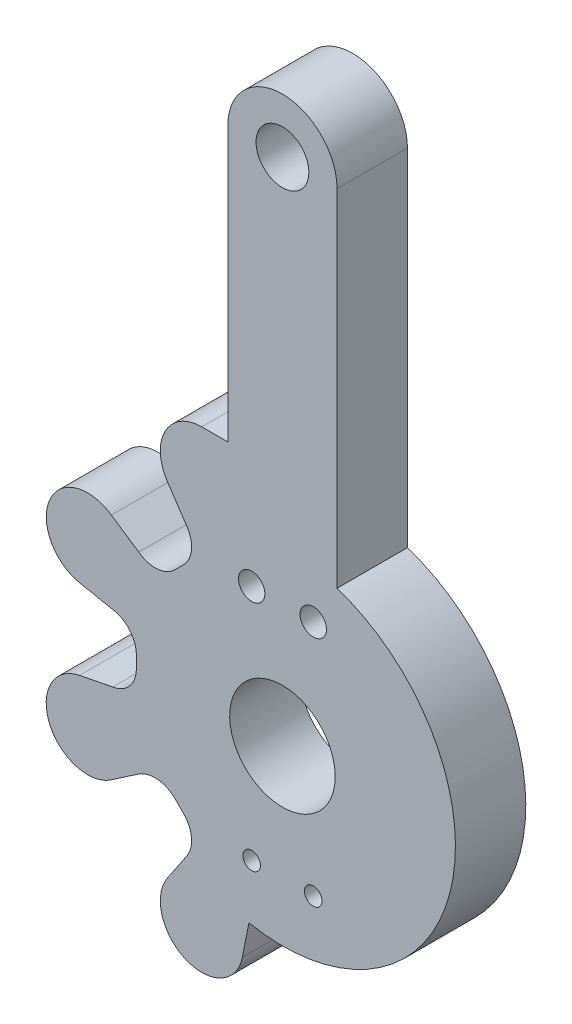
ISO-10303-21;
HEADER;
FILE_DESCRIPTION(('STEP AP214'),'2;1');
FILE_NAME('part.step','',(''),(''),'','','');
FILE_SCHEMA(('AUTOMOTIVE_DESIGN { 1 0 10303 214 1 1 1 1 }'));
ENDSEC;
DATA;
#1=APPLICATION_CONTEXT('core data for automotive mechanical design processes');
#2=APPLICATION_PROTOCOL_DEFINITION('international standard','automotive_design',2000,#1);
#3=PRODUCT_CONTEXT('',#1,'mechanical');
#4=PRODUCT('Part','Part','',(#3));
#5=PRODUCT_RELATED_PRODUCT_CATEGORY('part','',(#4));
#6=PRODUCT_DEFINITION_FORMATION('','',#4);
#7=PRODUCT_DEFINITION_CONTEXT('part definition',#1,'design');
#8=PRODUCT_DEFINITION('design','',#6,#7);
#9=PRODUCT_DEFINITION_SHAPE('','',#8);
#10=(LENGTH_UNIT() NAMED_UNIT(*) SI_UNIT(.MILLI.,.METRE.));
#11=(NAMED_UNIT(*) PLANE_ANGLE_UNIT() SI_UNIT($,.RADIAN.));
#12=(NAMED_UNIT(*) SI_UNIT($,.STERADIAN.) SOLID_ANGLE_UNIT());
#13=UNCERTAINTY_MEASURE_WITH_UNIT(LENGTH_MEASURE(1.E-05),#10,'distance_accuracy_value','');
#14=(GEOMETRIC_REPRESENTATION_CONTEXT(3) GLOBAL_UNCERTAINTY_ASSIGNED_CONTEXT((#13)) GLOBAL_UNIT_ASSIGNED_CONTEXT((#10,
#11,#12)) REPRESENTATION_CONTEXT('',''));
#15=CARTESIAN_POINT('',(0.,0.,0.));
#16=DIRECTION('',(0.,0.,1.));
#17=DIRECTION('',(1.,0.,0.));
#18=AXIS2_PLACEMENT_3D('',#15,#16,#17);
#19=CARTESIAN_POINT('',(6.69256607699613,20.6626330663528,-4.));
#20=DIRECTION('',(0.,0.,1.));
#21=DIRECTION('',(0.,-1.,0.));
#22=AXIS2_PLACEMENT_3D('',#19,#20,#21);
#23=CYLINDRICAL_SURFACE('',#22,1.57399668853809);
#24=CARTESIAN_POINT('',(6.69256607699613,20.6626330663528,0.));
#25=DIRECTION('',(0.,0.,-1.));
#26=DIRECTION('',(0.,1.,0.));
#27=AXIS2_PLACEMENT_3D('',#24,#25,#26);
#28=CIRCLE('',#27,1.57399668853809);
#29=CARTESIAN_POINT('',(7.95775462852621,21.598989571433,0.));
#30=VERTEX_POINT('',#29);
#31=CARTESIAN_POINT('',(7.80545011907268,19.5495496532969,0.));
#32=VERTEX_POINT('',#31);
#33=EDGE_CURVE('E272',#30,#32,#28,.T.);
#34=ORIENTED_EDGE('',*,*,#33,.F.);
#35=DIRECTION('',(0.,0.,1.));
#36=VECTOR('',#35,1.);
#37=CARTESIAN_POINT('',(7.95775462852621,21.598989571433,-4.));
#38=LINE('',#37,#36);
#39=CARTESIAN_POINT('',(7.95775462852621,21.598989571433,-4.));
#40=VERTEX_POINT('',#39);
#41=EDGE_CURVE('E11',#40,#30,#38,.T.);
#42=ORIENTED_EDGE('',*,*,#41,.F.);
#43=CARTESIAN_POINT('',(6.69256607699613,20.6626330663528,-4.));
#44=DIRECTION('',(0.,0.,-1.));
#45=DIRECTION('',(0.,1.,0.));
#46=AXIS2_PLACEMENT_3D('',#43,#44,#45);
#47=CIRCLE('',#46,1.57399668853809);
#48=CARTESIAN_POINT('',(7.80545011907268,19.5495496532969,-4.));
#49=VERTEX_POINT('',#48);
#50=EDGE_CURVE('E386',#40,#49,#47,.T.);
#51=ORIENTED_EDGE('',*,*,#50,.T.);
#52=DIRECTION('',(0.,0.,1.));
#53=VECTOR('',#52,1.);
#54=CARTESIAN_POINT('',(7.80545011907268,19.5495496532969,-4.));
#55=LINE('',#54,#53);
#56=EDGE_CURVE('E62',#49,#32,#55,.T.);
#57=ORIENTED_EDGE('',*,*,#56,.T.);
#58=EDGE_LOOP('',(#34,#42,#51,#57));
#59=FACE_BOUND('',#58,.T.);
#60=ADVANCED_FACE('F45',(#59),#23,.F.);
#61=CARTESIAN_POINT('',(15.4804527957904,10.3819858020936,-4.));
#62=DIRECTION('',(0.830519762885267,0.556989159191631,0.));
#63=DIRECTION('',(-0.55698915919163,0.830519762885267,0.));
#64=AXIS2_PLACEMENT_3D('',#61,#62,#63);
#65=PLANE('',#64);
#66=DIRECTION('',(-0.556989159191631,0.830519762885267,0.));
#67=VECTOR('',#66,1.);
#68=CARTESIAN_POINT('',(15.4804527957904,10.3819858020936,0.));
#69=LINE('',#68,#67);
#70=CARTESIAN_POINT('',(6.86639975184647,23.226295558356,0.));
#71=VERTEX_POINT('',#70);
#72=EDGE_CURVE('E275',#30,#71,#69,.T.);
#73=ORIENTED_EDGE('',*,*,#72,.T.);
#74=DIRECTION('',(0.,0.,1.));
#75=VECTOR('',#74,1.);
#76=CARTESIAN_POINT('',(6.86639975184647,23.226295558356,-4.));
#77=LINE('',#76,#75);
#78=CARTESIAN_POINT('',(6.86639975184647,23.226295558356,-4.));
#79=VERTEX_POINT('',#78);
#80=EDGE_CURVE('E54',#79,#71,#77,.T.);
#81=ORIENTED_EDGE('',*,*,#80,.F.);
#82=DIRECTION('',(-0.556989159191631,0.830519762885267,0.));
#83=VECTOR('',#82,1.);
#84=CARTESIAN_POINT('',(15.4804527957904,10.3819858020936,-4.));
#85=LINE('',#84,#83);
#86=EDGE_CURVE('E484',#40,#79,#85,.T.);
#87=ORIENTED_EDGE('',*,*,#86,.F.);
#88=ORIENTED_EDGE('',*,*,#41,.T.);
#89=EDGE_LOOP('',(#73,#81,#87,#88));
#90=FACE_BOUND('',#89,.T.);
#91=ADVANCED_FACE('F566',(#90),#65,.F.);
#92=CARTESIAN_POINT('',(8.84212914386415,24.5059761362511,-4.));
#93=DIRECTION('',(0.,0.,1.));
#94=DIRECTION('',(0.,-1.,0.));
#95=AXIS2_PLACEMENT_3D('',#92,#93,#94);
#96=CYLINDRICAL_SURFACE('',#95,2.35395178623617);
#97=CARTESIAN_POINT('',(8.84212914386415,24.5059761362511,0.));
#98=DIRECTION('',(0.,0.,-1.));
#99=DIRECTION('',(0.,1.,0.));
#100=AXIS2_PLACEMENT_3D('',#97,#98,#99);
#101=CIRCLE('',#100,2.35395178623617);
#102=CARTESIAN_POINT('',(8.84212914386416,26.8599279224873,0.));
#103=VERTEX_POINT('',#102);
#104=EDGE_CURVE('E278',#71,#103,#101,.T.);
#105=ORIENTED_EDGE('',*,*,#104,.T.);
#106=DIRECTION('',(0.,0.,1.));
#107=VECTOR('',#106,1.);
#108=CARTESIAN_POINT('',(8.84212914386416,26.8599279224873,-4.));
#109=LINE('',#108,#107);
#110=CARTESIAN_POINT('',(8.84212914386416,26.8599279224873,-4.));
#111=VERTEX_POINT('',#110);
#112=EDGE_CURVE('E451',#111,#103,#109,.T.);
#113=ORIENTED_EDGE('',*,*,#112,.F.);
#114=CARTESIAN_POINT('',(8.84212914386415,24.5059761362511,-4.));
#115=DIRECTION('',(0.,0.,-1.));
#116=DIRECTION('',(0.,1.,0.));
#117=AXIS2_PLACEMENT_3D('',#114,#115,#116);
#118=CIRCLE('',#117,2.35395178623617);
#119=EDGE_CURVE('E461',#79,#111,#118,.T.);
#120=ORIENTED_EDGE('',*,*,#119,.F.);
#121=ORIENTED_EDGE('',*,*,#80,.T.);
#122=EDGE_LOOP('',(#105,#113,#120,#121));
#123=FACE_BOUND('',#122,.T.);
#124=ADVANCED_FACE('F459',(#123),#96,.T.);
#125=CARTESIAN_POINT('',(1.25692176145882E-13,26.8599279224873,-4.));
#126=DIRECTION('',(0.,1.,0.));
#127=DIRECTION('',(-1.,0.,0.));
#128=AXIS2_PLACEMENT_3D('',#125,#126,#127);
#129=PLANE('',#128);
#130=DIRECTION('',(-1.,0.,0.));
#131=VECTOR('',#130,1.);
#132=CARTESIAN_POINT('',(1.25690431181717E-13,26.8599279224873,0.));
#133=LINE('',#132,#131);
#134=CARTESIAN_POINT('',(10.324964299798,26.8599279224873,0.));
#135=VERTEX_POINT('',#134);
#136=EDGE_CURVE('E282',#135,#103,#133,.T.);
#137=ORIENTED_EDGE('',*,*,#136,.F.);
#138=DIRECTION('',(0.,0.,1.));
#139=VECTOR('',#138,1.);
#140=CARTESIAN_POINT('',(10.324964299798,26.8599279224873,-4.));
#141=LINE('',#140,#139);
#142=CARTESIAN_POINT('',(10.324964299798,26.8599279224873,-4.));
#143=VERTEX_POINT('',#142);
#144=EDGE_CURVE('E448',#143,#135,#141,.T.);
#145=ORIENTED_EDGE('',*,*,#144,.F.);
#146=DIRECTION('',(-1.,0.,0.));
#147=VECTOR('',#146,1.);
#148=CARTESIAN_POINT('',(1.25692176145882E-13,26.8599279224873,-4.));
#149=LINE('',#148,#147);
#150=EDGE_CURVE('E474',#143,#111,#149,.T.);
#151=ORIENTED_EDGE('',*,*,#150,.T.);
#152=ORIENTED_EDGE('',*,*,#112,.T.);
#153=EDGE_LOOP('',(#137,#145,#151,#152));
#154=FACE_BOUND('',#153,.T.);
#155=ADVANCED_FACE('F471',(#154),#129,.T.);
#156=CARTESIAN_POINT('',(10.324964299798,0.,-4.));
#157=DIRECTION('',(-1.,0.,0.));
#158=DIRECTION('',(0.,-1.,0.));
#159=AXIS2_PLACEMENT_3D('',#156,#157,#158);
#160=PLANE('',#159);
#161=DIRECTION('',(0.,-1.,0.));
#162=VECTOR('',#161,1.);
#163=CARTESIAN_POINT('',(10.324964299798,0.,0.));
#164=LINE('',#163,#162);
#165=CARTESIAN_POINT('',(10.324964299798,42.4299674220899,0.));
#166=VERTEX_POINT('',#165);
#167=EDGE_CURVE('E286',#166,#135,#164,.T.);
#168=ORIENTED_EDGE('',*,*,#167,.F.);
#169=DIRECTION('',(0.,0.,1.));
#170=VECTOR('',#169,1.);
#171=CARTESIAN_POINT('',(10.324964299798,42.4299674220899,-4.));
#172=LINE('',#171,#170);
#173=CARTESIAN_POINT('',(10.324964299798,42.4299674220899,-4.));
#174=VERTEX_POINT('',#173);
#175=EDGE_CURVE('E445',#174,#166,#172,.T.);
#176=ORIENTED_EDGE('',*,*,#175,.F.);
#177=DIRECTION('',(0.,-1.,0.));
#178=VECTOR('',#177,1.);
#179=CARTESIAN_POINT('',(10.324964299798,0.,-4.));
#180=LINE('',#179,#178);
#181=EDGE_CURVE('E478',#174,#143,#180,.T.);
#182=ORIENTED_EDGE('',*,*,#181,.T.);
#183=ORIENTED_EDGE('',*,*,#144,.T.);
#184=EDGE_LOOP('',(#168,#176,#182,#183));
#185=FACE_BOUND('',#184,.T.);
#186=ADVANCED_FACE('F858',(#185),#160,.T.);
#187=CARTESIAN_POINT('',(13.4299644269049,42.4299674220899,-4.));
#188=DIRECTION('',(0.,0.,1.));
#189=DIRECTION('',(0.,-1.,0.));
#190=AXIS2_PLACEMENT_3D('',#187,#188,#189);
#191=CYLINDRICAL_SURFACE('',#190,3.10499982955597);
#192=CARTESIAN_POINT('',(13.4299644269049,42.4299674220899,0.));
#193=DIRECTION('',(0.,0.,-1.));
#194=DIRECTION('',(0.,1.,0.));
#195=AXIS2_PLACEMENT_3D('',#192,#193,#194);
#196=CIRCLE('',#195,3.10499982955597);
#197=CARTESIAN_POINT('',(16.53496395891,42.4299674220899,0.));
#198=VERTEX_POINT('',#197);
#199=EDGE_CURVE('E290',#166,#198,#196,.T.);
#200=ORIENTED_EDGE('',*,*,#199,.T.);
#201=DIRECTION('',(0.,0.,1.));
#202=VECTOR('',#201,1.);
#203=CARTESIAN_POINT('',(16.53496395891,42.4299674220899,-4.));
#204=LINE('',#203,#202);
#205=CARTESIAN_POINT('',(16.53496395891,42.4299674220899,-4.));
#206=VERTEX_POINT('',#205);
#207=EDGE_CURVE('E441',#206,#198,#204,.T.);
#208=ORIENTED_EDGE('',*,*,#207,.F.);
#209=CARTESIAN_POINT('',(13.4299644269049,42.4299674220899,-4.));
#210=DIRECTION('',(0.,0.,-1.));
#211=DIRECTION('',(0.,1.,0.));
#212=AXIS2_PLACEMENT_3D('',#209,#210,#211);
#213=CIRCLE('',#212,3.10499982955597);
#214=EDGE_CURVE('E482',#174,#206,#213,.T.);
#215=ORIENTED_EDGE('',*,*,#214,.F.);
#216=ORIENTED_EDGE('',*,*,#175,.T.);
#217=EDGE_LOOP('',(#200,#208,#215,#216));
#218=FACE_BOUND('',#217,.T.);
#219=ADVANCED_FACE('F847',(#218),#191,.T.);
#220=CARTESIAN_POINT('',(16.53496395891,0.,-4.));
#221=DIRECTION('',(-1.,0.,0.));
#222=DIRECTION('',(0.,0.,1.));
#223=AXIS2_PLACEMENT_3D('',#220,#221,#222);
#224=PLANE('',#223);
#225=DIRECTION('',(0.,-1.,0.));
#226=VECTOR('',#225,1.);
#227=CARTESIAN_POINT('',(16.53496395891,0.,0.));
#228=LINE('',#227,#226);
#229=CARTESIAN_POINT('',(16.53496395891,22.7593281729962,0.));
#230=VERTEX_POINT('',#229);
#231=EDGE_CURVE('E293',#198,#230,#228,.T.);
#232=ORIENTED_EDGE('',*,*,#231,.T.);
#233=DIRECTION('',(0.,0.,1.));
#234=VECTOR('',#233,1.);
#235=CARTESIAN_POINT('',(16.53496395891,22.7593281729962,-4.));
#236=LINE('',#235,#234);
#237=CARTESIAN_POINT('',(16.53496395891,22.7593281729962,-4.));
#238=VERTEX_POINT('',#237);
#239=EDGE_CURVE('E437',#238,#230,#236,.T.);
#240=ORIENTED_EDGE('',*,*,#239,.F.);
#241=DIRECTION('',(0.,-1.,0.));
#242=VECTOR('',#241,1.);
#243=CARTESIAN_POINT('',(16.53496395891,0.,-4.));
#244=LINE('',#243,#242);
#245=EDGE_CURVE('E490',#206,#238,#244,.T.);
#246=ORIENTED_EDGE('',*,*,#245,.F.);
#247=ORIENTED_EDGE('',*,*,#207,.T.);
#248=EDGE_LOOP('',(#232,#240,#246,#247));
#249=FACE_BOUND('',#248,.T.);
#250=ADVANCED_FACE('F836',(#249),#224,.F.);
#251=CARTESIAN_POINT('',(13.4299643635908,13.4299640810346,-4.));
#252=DIRECTION('',(0.,0.,1.));
#253=DIRECTION('',(0.,-1.,0.));
#254=AXIS2_PLACEMENT_3D('',#251,#252,#253);
#255=CYLINDRICAL_SURFACE('',#254,9.83250003037452);
#256=CARTESIAN_POINT('',(13.4299643635908,13.4299640810346,0.));
#257=DIRECTION('',(0.,0.,-1.));
#258=DIRECTION('',(0.,1.,0.));
#259=AXIS2_PLACEMENT_3D('',#256,#257,#258);
#260=CIRCLE('',#259,9.83250003037452);
#261=CARTESIAN_POINT('',(11.5238211932177,3.78399730411921,0.));
#262=VERTEX_POINT('',#261);
#263=EDGE_CURVE('E296',#230,#262,#260,.T.);
#264=ORIENTED_EDGE('',*,*,#263,.T.);
#265=DIRECTION('',(0.,0.,1.));
#266=VECTOR('',#265,1.);
#267=CARTESIAN_POINT('',(11.5238211932177,3.78399730411921,-4.));
#268=LINE('',#267,#266);
#269=CARTESIAN_POINT('',(11.5238211932177,3.78399730411921,-4.));
#270=VERTEX_POINT('',#269);
#271=EDGE_CURVE('E434',#270,#262,#268,.T.);
#272=ORIENTED_EDGE('',*,*,#271,.F.);
#273=CARTESIAN_POINT('',(13.4299643635908,13.4299640810346,-4.));
#274=DIRECTION('',(0.,0.,-1.));
#275=DIRECTION('',(0.,1.,0.));
#276=AXIS2_PLACEMENT_3D('',#273,#274,#275);
#277=CIRCLE('',#276,9.83250003037452);
#278=EDGE_CURVE('E493',#238,#270,#277,.T.);
#279=ORIENTED_EDGE('',*,*,#278,.F.);
#280=ORIENTED_EDGE('',*,*,#239,.T.);
#281=EDGE_LOOP('',(#264,#272,#279,#280));
#282=FACE_BOUND('',#281,.T.);
#283=ADVANCED_FACE('F825',(#282),#255,.T.);
#284=CARTESIAN_POINT('',(10.3725731493547,-2.0476794372538,-4.));
#285=DIRECTION('',(0.981065743318815,-0.193675004288887,0.));
#286=DIRECTION('',(0.193675004288887,0.981065743318815,0.));
#287=AXIS2_PLACEMENT_3D('',#284,#285,#286);
#288=PLANE('',#287);
#289=DIRECTION('',(0.193675004288887,0.981065743318815,0.));
#290=VECTOR('',#289,1.);
#291=CARTESIAN_POINT('',(10.3725731493547,-2.0476794372538,0.));
#292=LINE('',#291,#290);
#293=CARTESIAN_POINT('',(11.1515109927373,1.89805035437945,0.));
#294=VERTEX_POINT('',#293);
#295=EDGE_CURVE('E300',#294,#262,#292,.T.);
#296=ORIENTED_EDGE('',*,*,#295,.F.);
#297=DIRECTION('',(0.,0.,1.));
#298=VECTOR('',#297,1.);
#299=CARTESIAN_POINT('',(11.1515109927373,1.89805035437945,-4.));
#300=LINE('',#299,#298);
#301=CARTESIAN_POINT('',(11.1515109927373,1.89805035437945,-4.));
#302=VERTEX_POINT('',#301);
#303=EDGE_CURVE('E431',#302,#294,#300,.T.);
#304=ORIENTED_EDGE('',*,*,#303,.F.);
#305=DIRECTION('',(0.193675004288887,0.981065743318815,0.));
#306=VECTOR('',#305,1.);
#307=CARTESIAN_POINT('',(10.3725731493547,-2.0476794372538,-4.));
#308=LINE('',#307,#306);
#309=EDGE_CURVE('E496',#302,#270,#308,.T.);
#310=ORIENTED_EDGE('',*,*,#309,.T.);
#311=ORIENTED_EDGE('',*,*,#271,.T.);
#312=EDGE_LOOP('',(#296,#304,#310,#311));
#313=FACE_BOUND('',#312,.T.);
#314=ADVANCED_FACE('F814',(#313),#288,.T.);
#315=CARTESIAN_POINT('',(8.84212942262603,2.35395199862902,-4.));
#316=DIRECTION('',(0.,0.,1.));
#317=DIRECTION('',(0.,-1.,0.));
#318=AXIS2_PLACEMENT_3D('',#315,#316,#317);
#319=CYLINDRICAL_SURFACE('',#318,2.35395189959334);
#320=CARTESIAN_POINT('',(8.84212942262603,2.35395199862902,0.));
#321=DIRECTION('',(0.,0.,-1.));
#322=DIRECTION('',(0.,1.,0.));
#323=AXIS2_PLACEMENT_3D('',#320,#321,#322);
#324=CIRCLE('',#323,2.35395189959334);
#325=CARTESIAN_POINT('',(6.86639975184648,3.63363235465564,0.));
#326=VERTEX_POINT('',#325);
#327=EDGE_CURVE('E304',#294,#326,#324,.T.);
#328=ORIENTED_EDGE('',*,*,#327,.T.);
#329=DIRECTION('',(0.,0.,1.));
#330=VECTOR('',#329,1.);
#331=CARTESIAN_POINT('',(6.86639975184648,3.63363235465564,-4.));
#332=LINE('',#331,#330);
#333=CARTESIAN_POINT('',(6.86639975184648,3.63363235465564,-4.));
#334=VERTEX_POINT('',#333);
#335=EDGE_CURVE('E427',#334,#326,#332,.T.);
#336=ORIENTED_EDGE('',*,*,#335,.F.);
#337=CARTESIAN_POINT('',(8.84212942262603,2.35395199862902,-4.));
#338=DIRECTION('',(0.,0.,-1.));
#339=DIRECTION('',(0.,1.,0.));
#340=AXIS2_PLACEMENT_3D('',#337,#338,#339);
#341=CIRCLE('',#340,2.35395189959334);
#342=EDGE_CURVE('E500',#302,#334,#341,.T.);
#343=ORIENTED_EDGE('',*,*,#342,.F.);
#344=ORIENTED_EDGE('',*,*,#303,.T.);
#345=EDGE_LOOP('',(#328,#336,#343,#344));
#346=FACE_BOUND('',#345,.T.);
#347=ADVANCED_FACE('F803',(#346),#319,.T.);
#348=CARTESIAN_POINT('',(3.05876763685765,-2.04938129675285,-4.));
#349=DIRECTION('',(0.830769101313786,-0.556617193681874,0.));
#350=DIRECTION('',(0.556617193681874,0.830769101313786,0.));
#351=AXIS2_PLACEMENT_3D('',#348,#349,#350);
#352=PLANE('',#351);
#353=DIRECTION('',(0.556617193681874,0.830769101313786,0.));
#354=VECTOR('',#353,1.);
#355=CARTESIAN_POINT('',(3.05876763685765,-2.04938129675285,0.));
#356=LINE('',#355,#354);
#357=CARTESIAN_POINT('',(7.95702578980674,5.26142686713257,0.));
#358=VERTEX_POINT('',#357);
#359=EDGE_CURVE('E307',#326,#358,#356,.T.);
#360=ORIENTED_EDGE('',*,*,#359,.T.);
#361=DIRECTION('',(0.,0.,1.));
#362=VECTOR('',#361,1.);
#363=CARTESIAN_POINT('',(7.95702578980674,5.26142686713257,-4.));
#364=LINE('',#363,#362);
#365=CARTESIAN_POINT('',(7.95702578980674,5.26142686713257,-4.));
#366=VERTEX_POINT('',#365);
#367=EDGE_CURVE('E424',#366,#358,#364,.T.);
#368=ORIENTED_EDGE('',*,*,#367,.F.);
#369=DIRECTION('',(0.556617193681874,0.830769101313786,0.));
#370=VECTOR('',#369,1.);
#371=CARTESIAN_POINT('',(3.05876763685765,-2.04938129675285,-4.));
#372=LINE('',#371,#370);
#373=EDGE_CURVE('E503',#334,#366,#372,.T.);
#374=ORIENTED_EDGE('',*,*,#373,.F.);
#375=ORIENTED_EDGE('',*,*,#335,.T.);
#376=EDGE_LOOP('',(#360,#368,#374,#375));
#377=FACE_BOUND('',#376,.T.);
#378=ADVANCED_FACE('F792',(#377),#352,.F.);
#379=CARTESIAN_POINT('',(6.69060782848511,6.19777630821553,-4.));
#380=DIRECTION('',(0.,0.,1.));
#381=DIRECTION('',(0.,-1.,0.));
#382=AXIS2_PLACEMENT_3D('',#379,#380,#381);
#383=CYLINDRICAL_SURFACE('',#382,1.57498086609787);
#384=CARTESIAN_POINT('',(6.69060782848511,6.19777630821553,0.));
#385=DIRECTION('',(0.,0.,-1.));
#386=DIRECTION('',(0.,1.,0.));
#387=AXIS2_PLACEMENT_3D('',#384,#385,#386);
#388=CIRCLE('',#387,1.57498086609787);
#389=CARTESIAN_POINT('',(7.80288812555303,7.31285355635976,0.));
#390=VERTEX_POINT('',#389);
#391=EDGE_CURVE('E311',#390,#358,#388,.T.);
#392=ORIENTED_EDGE('',*,*,#391,.F.);
#393=DIRECTION('',(0.,0.,1.));
#394=VECTOR('',#393,1.);
#395=CARTESIAN_POINT('',(7.80288812555303,7.31285355635976,-4.));
#396=LINE('',#395,#394);
#397=CARTESIAN_POINT('',(7.80288812555303,7.31285355635976,-4.));
#398=VERTEX_POINT('',#397);
#399=EDGE_CURVE('E421',#398,#390,#396,.T.);
#400=ORIENTED_EDGE('',*,*,#399,.F.);
#401=CARTESIAN_POINT('',(6.69060782848511,6.19777630821553,-4.));
#402=DIRECTION('',(0.,0.,-1.));
#403=DIRECTION('',(0.,1.,0.));
#404=AXIS2_PLACEMENT_3D('',#401,#402,#403);
#405=CIRCLE('',#404,1.57498086609787);
#406=EDGE_CURVE('E506',#398,#366,#405,.T.);
#407=ORIENTED_EDGE('',*,*,#406,.T.);
#408=ORIENTED_EDGE('',*,*,#367,.T.);
#409=EDGE_LOOP('',(#392,#400,#407,#408));
#410=FACE_BOUND('',#409,.T.);
#411=ADVANCED_FACE('F781',(#410),#383,.F.);
#412=CARTESIAN_POINT('',(7.54806103463607,7.56704146384131,-4.));
#413=DIRECTION('',(-0.706218291923553,-0.707994155450862,0.));
#414=DIRECTION('',(0.707994155450862,-0.706218291923553,0.));
#415=AXIS2_PLACEMENT_3D('',#412,#413,#414);
#416=PLANE('',#415);
#417=DIRECTION('',(0.707994155450862,-0.706218291923553,0.));
#418=VECTOR('',#417,1.);
#419=CARTESIAN_POINT('',(7.54806103463607,7.56704146384131,0.));
#420=LINE('',#419,#418);
#421=CARTESIAN_POINT('',(7.33640105933805,7.778170531889,0.));
#422=VERTEX_POINT('',#421);
#423=EDGE_CURVE('E315',#422,#390,#420,.T.);
#424=ORIENTED_EDGE('',*,*,#423,.F.);
#425=DIRECTION('',(0.,0.,1.));
#426=VECTOR('',#425,1.);
#427=CARTESIAN_POINT('',(7.33640105933805,7.778170531889,-4.));
#428=LINE('',#427,#426);
#429=CARTESIAN_POINT('',(7.33640105933805,7.778170531889,-4.));
#430=VERTEX_POINT('',#429);
#431=EDGE_CURVE('E418',#430,#422,#428,.T.);
#432=ORIENTED_EDGE('',*,*,#431,.F.);
#433=DIRECTION('',(0.707994155450862,-0.706218291923553,0.));
#434=VECTOR('',#433,1.);
#435=CARTESIAN_POINT('',(7.54806103463607,7.56704146384131,-4.));
#436=LINE('',#435,#434);
#437=EDGE_CURVE('E510',#430,#398,#436,.T.);
#438=ORIENTED_EDGE('',*,*,#437,.T.);
#439=ORIENTED_EDGE('',*,*,#399,.T.);
#440=EDGE_LOOP('',(#424,#432,#438,#439));
#441=FACE_BOUND('',#440,.T.);
#442=ADVANCED_FACE('F770',(#441),#416,.T.);
#443=CARTESIAN_POINT('',(6.17760406045255,6.61645961056704,-4.));
#444=DIRECTION('',(0.,0.,1.));
#445=DIRECTION('',(0.,-1.,0.));
#446=AXIS2_PLACEMENT_3D('',#443,#444,#445);
#447=CYLINDRICAL_SURFACE('',#446,1.64084817985844);
#448=CARTESIAN_POINT('',(6.17760406045255,6.61645961056704,0.));
#449=DIRECTION('',(0.,0.,-1.));
#450=DIRECTION('',(0.,1.,0.));
#451=AXIS2_PLACEMENT_3D('',#448,#449,#450);
#452=CIRCLE('',#451,1.64084817985844);
#453=CARTESIAN_POINT('',(5.2519104301641,7.97125629353765,0.));
#454=VERTEX_POINT('',#453);
#455=EDGE_CURVE('E319',#454,#422,#452,.T.);
#456=ORIENTED_EDGE('',*,*,#455,.F.);
#457=DIRECTION('',(0.,0.,1.));
#458=VECTOR('',#457,1.);
#459=CARTESIAN_POINT('',(5.2519104301641,7.97125629353765,-4.));
#460=LINE('',#459,#458);
#461=CARTESIAN_POINT('',(5.2519104301641,7.97125629353765,-4.));
#462=VERTEX_POINT('',#461);
#463=EDGE_CURVE('E415',#462,#454,#460,.T.);
#464=ORIENTED_EDGE('',*,*,#463,.F.);
#465=CARTESIAN_POINT('',(6.17760406045255,6.61645961056704,-4.));
#466=DIRECTION('',(0.,0.,-1.));
#467=DIRECTION('',(0.,1.,0.));
#468=AXIS2_PLACEMENT_3D('',#465,#466,#467);
#469=CIRCLE('',#468,1.64084817985844);
#470=EDGE_CURVE('E514',#462,#430,#469,.T.);
#471=ORIENTED_EDGE('',*,*,#470,.T.);
#472=ORIENTED_EDGE('',*,*,#431,.T.);
#473=EDGE_LOOP('',(#456,#464,#471,#472));
#474=FACE_BOUND('',#473,.T.);
#475=ADVANCED_FACE('F759',(#474),#447,.F.);
#476=CARTESIAN_POINT('',(-2.04152151344835,2.98786389377135,-4.));
#477=DIRECTION('',(0.564155563964672,-0.825668516807867,0.));
#478=DIRECTION('',(0.825668516807867,0.564155563964672,0.));
#479=AXIS2_PLACEMENT_3D('',#476,#477,#478);
#480=PLANE('',#479);
#481=DIRECTION('',(0.825668516807867,0.564155563964672,0.));
#482=VECTOR('',#481,1.);
#483=CARTESIAN_POINT('',(-2.04152151344835,2.98786389377135,0.));
#484=LINE('',#483,#482);
#485=CARTESIAN_POINT('',(3.68194692450449,6.89854535820541,0.));
#486=VERTEX_POINT('',#485);
#487=EDGE_CURVE('E323',#486,#454,#484,.T.);
#488=ORIENTED_EDGE('',*,*,#487,.F.);
#489=DIRECTION('',(0.,0.,1.));
#490=VECTOR('',#489,1.);
#491=CARTESIAN_POINT('',(3.68194692450449,6.89854535820541,-4.));
#492=LINE('',#491,#490);
#493=CARTESIAN_POINT('',(3.68194692450449,6.89854535820541,-4.));
#494=VERTEX_POINT('',#493);
#495=EDGE_CURVE('E412',#494,#486,#492,.T.);
#496=ORIENTED_EDGE('',*,*,#495,.F.);
#497=DIRECTION('',(0.825668516807867,0.564155563964672,0.));
#498=VECTOR('',#497,1.);
#499=CARTESIAN_POINT('',(-2.04152151344835,2.98786389377135,-4.));
#500=LINE('',#499,#498);
#501=EDGE_CURVE('E518',#494,#462,#500,.T.);
#502=ORIENTED_EDGE('',*,*,#501,.T.);
#503=ORIENTED_EDGE('',*,*,#463,.T.);
#504=EDGE_LOOP('',(#488,#496,#502,#503));
#505=FACE_BOUND('',#504,.T.);
#506=ADVANCED_FACE('F748',(#505),#480,.T.);
#507=CARTESIAN_POINT('',(2.35395185254456,8.84212934714569,-4.));
#508=DIRECTION('',(0.,0.,1.));
#509=DIRECTION('',(0.,-1.,0.));
#510=AXIS2_PLACEMENT_3D('',#507,#508,#509);
#511=CYLINDRICAL_SURFACE('',#510,2.3539519182037);
#512=CARTESIAN_POINT('',(2.35395185254456,8.84212934714569,0.));
#513=DIRECTION('',(0.,0.,-1.));
#514=DIRECTION('',(0.,1.,0.));
#515=AXIS2_PLACEMENT_3D('',#512,#513,#514);
#516=CIRCLE('',#515,2.3539519182037);
#517=CARTESIAN_POINT('',(1.89874110829165,11.1516472214068,0.));
#518=VERTEX_POINT('',#517);
#519=EDGE_CURVE('E327',#486,#518,#516,.T.);
#520=ORIENTED_EDGE('',*,*,#519,.T.);
#521=DIRECTION('',(0.,0.,1.));
#522=VECTOR('',#521,1.);
#523=CARTESIAN_POINT('',(1.89874110829165,11.1516472214068,-4.));
#524=LINE('',#523,#522);
#525=CARTESIAN_POINT('',(1.89874110829165,11.1516472214068,-4.));
#526=VERTEX_POINT('',#525);
#527=EDGE_CURVE('E408',#526,#518,#524,.T.);
#528=ORIENTED_EDGE('',*,*,#527,.F.);
#529=CARTESIAN_POINT('',(2.35395185254456,8.84212934714569,-4.));
#530=DIRECTION('',(0.,0.,-1.));
#531=DIRECTION('',(0.,1.,0.));
#532=AXIS2_PLACEMENT_3D('',#529,#530,#531);
#533=CIRCLE('',#532,2.3539519182037);
#534=EDGE_CURVE('E522',#494,#526,#533,.T.);
#535=ORIENTED_EDGE('',*,*,#534,.F.);
#536=ORIENTED_EDGE('',*,*,#495,.T.);
#537=EDGE_LOOP('',(#520,#528,#535,#536));
#538=FACE_BOUND('',#537,.T.);
#539=ADVANCED_FACE('F737',(#538),#511,.T.);
#540=CARTESIAN_POINT('',(-2.04480884841034,10.3743653779557,-4.));
#541=DIRECTION('',(0.193381496339268,-0.981123639952471,0.));
#542=DIRECTION('',(0.981123639952471,0.193381496339268,0.));
#543=AXIS2_PLACEMENT_3D('',#540,#541,#542);
#544=PLANE('',#543);
#545=DIRECTION('',(0.981123639952471,0.193381496339268,0.));
#546=VECTOR('',#545,1.);
#547=CARTESIAN_POINT('',(-2.04480884841034,10.3743653779557,0.));
#548=LINE('',#547,#546);
#549=CARTESIAN_POINT('',(3.78410901263927,11.5232571303378,0.));
#550=VERTEX_POINT('',#549);
#551=EDGE_CURVE('E330',#518,#550,#548,.T.);
#552=ORIENTED_EDGE('',*,*,#551,.T.);
#553=DIRECTION('',(0.,0.,1.));
#554=VECTOR('',#553,1.);
#555=CARTESIAN_POINT('',(3.78410901263927,11.5232571303378,-4.));
#556=LINE('',#555,#554);
#557=CARTESIAN_POINT('',(3.78410901263927,11.5232571303378,-4.));
#558=VERTEX_POINT('',#557);
#559=EDGE_CURVE('E405',#558,#550,#556,.T.);
#560=ORIENTED_EDGE('',*,*,#559,.F.);
#561=DIRECTION('',(0.981123639952471,0.193381496339268,0.));
#562=VECTOR('',#561,1.);
#563=CARTESIAN_POINT('',(-2.04480884841034,10.3743653779557,-4.));
#564=LINE('',#563,#562);
#565=EDGE_CURVE('E525',#526,#558,#564,.T.);
#566=ORIENTED_EDGE('',*,*,#565,.F.);
#567=ORIENTED_EDGE('',*,*,#527,.T.);
#568=EDGE_LOOP('',(#552,#560,#566,#567));
#569=FACE_BOUND('',#568,.T.);
#570=ADVANCED_FACE('F726',(#569),#544,.F.);
#571=CARTESIAN_POINT('',(3.55097190573457,13.0808051425338,-4.));
#572=DIRECTION('',(0.,0.,1.));
#573=DIRECTION('',(0.,-1.,0.));
#574=AXIS2_PLACEMENT_3D('',#571,#572,#573);
#575=CYLINDRICAL_SURFACE('',#574,1.5748995907396);
#576=CARTESIAN_POINT('',(3.55097190573457,13.0808051425338,0.));
#577=DIRECTION('',(0.,0.,-1.));
#578=DIRECTION('',(0.,1.,0.));
#579=AXIS2_PLACEMENT_3D('',#576,#577,#578);
#580=CIRCLE('',#579,1.5748995907396);
#581=CARTESIAN_POINT('',(5.12587149350252,13.0807083948984,0.));
#582=VERTEX_POINT('',#581);
#583=EDGE_CURVE('E334',#582,#550,#580,.T.);
#584=ORIENTED_EDGE('',*,*,#583,.F.);
#585=DIRECTION('',(0.,0.,1.));
#586=VECTOR('',#585,1.);
#587=CARTESIAN_POINT('',(5.12587149350252,13.0807083948984,-4.));
#588=LINE('',#587,#586);
#589=CARTESIAN_POINT('',(5.12587149350252,13.0807083948984,-4.));
#590=VERTEX_POINT('',#589);
#591=EDGE_CURVE('E402',#590,#582,#588,.T.);
#592=ORIENTED_EDGE('',*,*,#591,.F.);
#593=CARTESIAN_POINT('',(3.55097190573457,13.0808051425338,-4.));
#594=DIRECTION('',(0.,0.,-1.));
#595=DIRECTION('',(0.,1.,0.));
#596=AXIS2_PLACEMENT_3D('',#593,#594,#595);
#597=CIRCLE('',#596,1.5748995907396);
#598=EDGE_CURVE('E528',#590,#558,#597,.T.);
#599=ORIENTED_EDGE('',*,*,#598,.T.);
#600=ORIENTED_EDGE('',*,*,#559,.T.);
#601=EDGE_LOOP('',(#584,#592,#599,#600));
#602=FACE_BOUND('',#601,.T.);
#603=ADVANCED_FACE('F715',(#602),#575,.F.);
#604=CARTESIAN_POINT('',(5.12506791333996,-0.000314837978161413,-4.));
#605=DIRECTION('',(0.999999998113117,-6.14309864553934E-05,0.));
#606=DIRECTION('',(6.14309864553934E-05,0.999999998113117,0.));
#607=AXIS2_PLACEMENT_3D('',#604,#605,#606);
#608=PLANE('',#607);
#609=DIRECTION('',(6.14309864553934E-05,0.999999998113117,0.));
#610=VECTOR('',#609,1.);
#611=CARTESIAN_POINT('',(5.12506791333996,-0.000314837978161421,0.));
#612=LINE('',#611,#610);
#613=CARTESIAN_POINT('',(5.12591437754093,13.7787932020696,0.));
#614=VERTEX_POINT('',#613);
#615=EDGE_CURVE('E338',#582,#614,#612,.T.);
#616=ORIENTED_EDGE('',*,*,#615,.T.);
#617=DIRECTION('',(0.,0.,1.));
#618=VECTOR('',#617,1.);
#619=CARTESIAN_POINT('',(5.12591437754093,13.7787932020696,-4.));
#620=LINE('',#619,#618);
#621=CARTESIAN_POINT('',(5.12591437754093,13.7787932020696,-4.));
#622=VERTEX_POINT('',#621);
#623=EDGE_CURVE('E399',#622,#614,#620,.T.);
#624=ORIENTED_EDGE('',*,*,#623,.F.);
#625=DIRECTION('',(6.14309864553934E-05,0.999999998113117,0.));
#626=VECTOR('',#625,1.);
#627=CARTESIAN_POINT('',(5.12506791333996,-0.000314837978161413,-4.));
#628=LINE('',#627,#626);
#629=EDGE_CURVE('E532',#590,#622,#628,.T.);
#630=ORIENTED_EDGE('',*,*,#629,.F.);
#631=ORIENTED_EDGE('',*,*,#591,.T.);
#632=EDGE_LOOP('',(#616,#624,#630,#631));
#633=FACE_BOUND('',#632,.T.);
#634=ADVANCED_FACE('F705',(#633),#608,.F.);
#635=CARTESIAN_POINT('',(3.55133353124685,13.7787932020696,-4.));
#636=DIRECTION('',(0.,0.,1.));
#637=DIRECTION('',(0.,-1.,0.));
#638=AXIS2_PLACEMENT_3D('',#635,#636,#637);
#639=CYLINDRICAL_SURFACE('',#638,1.57458084629409);
#640=CARTESIAN_POINT('',(3.55133353124685,13.7787932020696,0.));
#641=DIRECTION('',(0.,0.,-1.));
#642=DIRECTION('',(0.,1.,0.));
#643=AXIS2_PLACEMENT_3D('',#640,#641,#642);
#644=CIRCLE('',#643,1.57458084629409);
#645=CARTESIAN_POINT('',(3.78399421142372,15.3360901709923,0.));
#646=VERTEX_POINT('',#645);
#647=EDGE_CURVE('E342',#646,#614,#644,.T.);
#648=ORIENTED_EDGE('',*,*,#647,.F.);
#649=DIRECTION('',(0.,0.,1.));
#650=VECTOR('',#649,1.);
#651=CARTESIAN_POINT('',(3.78399421142372,15.3360901709923,-4.));
#652=LINE('',#651,#650);
#653=CARTESIAN_POINT('',(3.78399421142372,15.3360901709923,-4.));
#654=VERTEX_POINT('',#653);
#655=EDGE_CURVE('E396',#654,#646,#652,.T.);
#656=ORIENTED_EDGE('',*,*,#655,.F.);
#657=CARTESIAN_POINT('',(3.55133353124685,13.7787932020696,-4.));
#658=DIRECTION('',(0.,0.,-1.));
#659=DIRECTION('',(0.,1.,0.));
#660=AXIS2_PLACEMENT_3D('',#657,#658,#659);
#661=CIRCLE('',#660,1.57458084629409);
#662=EDGE_CURVE('E535',#654,#622,#661,.T.);
#663=ORIENTED_EDGE('',*,*,#662,.T.);
#664=ORIENTED_EDGE('',*,*,#623,.T.);
#665=EDGE_LOOP('',(#648,#656,#663,#664));
#666=FACE_BOUND('',#665,.T.);
#667=ADVANCED_FACE('F552',(#666),#639,.F.);
#668=CARTESIAN_POINT('',(3.05599050269329,15.4798110736071,-4.));
#669=DIRECTION('',(-0.193679674904566,-0.981064821267617,0.));
#670=DIRECTION('',(0.981064821267617,-0.193679674904566,0.));
#671=AXIS2_PLACEMENT_3D('',#668,#669,#670);
#672=PLANE('',#671);
#673=DIRECTION('',(0.981064821267617,-0.193679674904566,0.));
#674=VECTOR('',#673,1.);
#675=CARTESIAN_POINT('',(3.05599050269329,15.4798110736071,0.));
#676=LINE('',#675,#674);
#677=CARTESIAN_POINT('',(1.90356185999294,15.7073210199739,0.));
#678=VERTEX_POINT('',#677);
#679=EDGE_CURVE('E346',#678,#646,#676,.T.);
#680=ORIENTED_EDGE('',*,*,#679,.F.);
#681=DIRECTION('',(0.,0.,1.));
#682=VECTOR('',#681,1.);
#683=CARTESIAN_POINT('',(1.90356185999294,15.7073210199739,-4.));
#684=LINE('',#683,#682);
#685=CARTESIAN_POINT('',(1.90356185999294,15.7073210199739,-4.));
#686=VERTEX_POINT('',#685);
#687=EDGE_CURVE('E393',#686,#678,#684,.T.);
#688=ORIENTED_EDGE('',*,*,#687,.F.);
#689=DIRECTION('',(0.981064821267617,-0.193679674904566,0.));
#690=VECTOR('',#689,1.);
#691=CARTESIAN_POINT('',(3.05599050269329,15.4798110736071,-4.));
#692=LINE('',#691,#690);
#693=EDGE_CURVE('E539',#686,#654,#692,.T.);
#694=ORIENTED_EDGE('',*,*,#693,.T.);
#695=ORIENTED_EDGE('',*,*,#655,.T.);
#696=EDGE_LOOP('',(#680,#688,#694,#695));
#697=FACE_BOUND('',#696,.T.);
#698=ADVANCED_FACE('F545',(#697),#672,.T.);
#699=CARTESIAN_POINT('',(2.35925735020569,18.0156004761343,-4.));
#700=DIRECTION('',(0.,0.,1.));
#701=DIRECTION('',(0.,-1.,0.));
#702=AXIS2_PLACEMENT_3D('',#699,#700,#701);
#703=CYLINDRICAL_SURFACE('',#702,2.35283072649358);
#704=CARTESIAN_POINT('',(2.35925735020569,18.0156004761343,0.));
#705=DIRECTION('',(0.,0.,-1.));
#706=DIRECTION('',(0.,1.,0.));
#707=AXIS2_PLACEMENT_3D('',#704,#705,#706);
#708=CIRCLE('',#707,2.35283072649358);
#709=CARTESIAN_POINT('',(3.70363712623404,19.9465213562685,0.));
#710=VERTEX_POINT('',#709);
#711=EDGE_CURVE('E350',#678,#710,#708,.T.);
#712=ORIENTED_EDGE('',*,*,#711,.T.);
#713=DIRECTION('',(0.,0.,1.));
#714=VECTOR('',#713,1.);
#715=CARTESIAN_POINT('',(3.70363712623404,19.9465213562685,-4.));
#716=LINE('',#715,#714);
#717=CARTESIAN_POINT('',(3.70363712623404,19.9465213562685,-4.));
#718=VERTEX_POINT('',#717);
#719=EDGE_CURVE('E238',#718,#710,#716,.T.);
#720=ORIENTED_EDGE('',*,*,#719,.F.);
#721=CARTESIAN_POINT('',(2.35925735020569,18.0156004761343,-4.));
#722=DIRECTION('',(0.,0.,-1.));
#723=DIRECTION('',(0.,1.,0.));
#724=AXIS2_PLACEMENT_3D('',#721,#722,#723);
#725=CIRCLE('',#724,2.35283072649358);
#726=EDGE_CURVE('E224',#686,#718,#725,.T.);
#727=ORIENTED_EDGE('',*,*,#726,.F.);
#728=ORIENTED_EDGE('',*,*,#687,.T.);
#729=EDGE_LOOP('',(#712,#720,#727,#728));
#730=FACE_BOUND('',#729,.T.);
#731=ADVANCED_FACE('F556',(#730),#703,.T.);
#732=CARTESIAN_POINT('',(10.371067156681,15.4793994291812,-4.));
#733=DIRECTION('',(-0.5566110527492,-0.830773215719806,0.));
#734=DIRECTION('',(0.830773215719806,-0.5566110527492,0.));
#735=AXIS2_PLACEMENT_3D('',#732,#733,#734);
#736=PLANE('',#735);
#737=DIRECTION('',(0.830773215719806,-0.5566110527492,0.));
#738=VECTOR('',#737,1.);
#739=CARTESIAN_POINT('',(10.371067156681,15.4793994291812,0.));
#740=LINE('',#739,#738);
#741=CARTESIAN_POINT('',(5.26138669479144,18.9028422740979,0.));
#742=VERTEX_POINT('',#741);
#743=EDGE_CURVE('E234',#710,#742,#740,.T.);
#744=ORIENTED_EDGE('',*,*,#743,.T.);
#745=DIRECTION('',(0.,0.,1.));
#746=VECTOR('',#745,1.);
#747=CARTESIAN_POINT('',(5.26138669479144,18.9028422740979,-4.));
#748=LINE('',#747,#746);
#749=CARTESIAN_POINT('',(5.26138669479144,18.9028422740979,-4.));
#750=VERTEX_POINT('',#749);
#751=EDGE_CURVE('E231',#750,#742,#748,.T.);
#752=ORIENTED_EDGE('',*,*,#751,.F.);
#753=DIRECTION('',(0.830773215719806,-0.5566110527492,0.));
#754=VECTOR('',#753,1.);
#755=CARTESIAN_POINT('',(10.371067156681,15.4793994291812,-4.));
#756=LINE('',#755,#754);
#757=EDGE_CURVE('E214',#718,#750,#756,.T.);
#758=ORIENTED_EDGE('',*,*,#757,.F.);
#759=ORIENTED_EDGE('',*,*,#719,.T.);
#760=EDGE_LOOP('',(#744,#752,#758,#759));
#761=FACE_BOUND('',#760,.T.);
#762=ADVANCED_FACE('F232',(#761),#736,.F.);
#763=CARTESIAN_POINT('',(6.19770422809215,20.1695191125913,-4.));
#764=DIRECTION('',(0.,0.,1.));
#765=DIRECTION('',(0.,-1.,0.));
#766=AXIS2_PLACEMENT_3D('',#763,#764,#765);
#767=CYLINDRICAL_SURFACE('',#766,1.57517006584745);
#768=CARTESIAN_POINT('',(6.19770422809215,20.1695191125913,0.));
#769=DIRECTION('',(0.,0.,-1.));
#770=DIRECTION('',(0.,1.,0.));
#771=AXIS2_PLACEMENT_3D('',#768,#769,#770);
#772=CIRCLE('',#771,1.57517006584745);
#773=CARTESIAN_POINT('',(7.31141789890455,19.0556059221731,0.));
#774=VERTEX_POINT('',#773);
#775=EDGE_CURVE('E355',#774,#742,#772,.T.);
#776=ORIENTED_EDGE('',*,*,#775,.F.);
#777=DIRECTION('',(0.,0.,1.));
#778=VECTOR('',#777,1.);
#779=CARTESIAN_POINT('',(7.31141789890455,19.0556059221731,-4.));
#780=LINE('',#779,#778);
#781=CARTESIAN_POINT('',(7.31141789890455,19.0556059221731,-4.));
#782=VERTEX_POINT('',#781);
#783=EDGE_CURVE('E138',#782,#774,#780,.T.);
#784=ORIENTED_EDGE('',*,*,#783,.F.);
#785=CARTESIAN_POINT('',(6.19770422809215,20.1695191125913,-4.));
#786=DIRECTION('',(0.,0.,-1.));
#787=DIRECTION('',(0.,1.,0.));
#788=AXIS2_PLACEMENT_3D('',#785,#786,#787);
#789=CIRCLE('',#788,1.57517006584745);
#790=EDGE_CURVE('E221',#782,#750,#789,.T.);
#791=ORIENTED_EDGE('',*,*,#790,.T.);
#792=ORIENTED_EDGE('',*,*,#751,.T.);
#793=EDGE_LOOP('',(#776,#784,#791,#792));
#794=FACE_BOUND('',#793,.T.);
#795=ADVANCED_FACE('F240',(#794),#767,.F.);
#796=CARTESIAN_POINT('',(13.4299646097295,13.4299627806019,-4.));
#797=DIRECTION('',(0.,0.,1.));
#798=DIRECTION('',(0.,-1.,0.));
#799=AXIS2_PLACEMENT_3D('',#796,#797,#798);
#800=CYLINDRICAL_SURFACE('',#799,3.00000020890183);
#801=CARTESIAN_POINT('',(13.4299646097295,13.4299627806019,-4.));
#802=DIRECTION('',(0.,0.,-1.));
#803=DIRECTION('',(0.,1.,0.));
#804=AXIS2_PLACEMENT_3D('',#801,#802,#803);
#805=CIRCLE('',#804,3.00000020890183);
#806=CARTESIAN_POINT('',(13.4299646097295,16.4299629895038,-4.));
#807=VERTEX_POINT('',#806);
#808=EDGE_CURVE('E264',#807,#807,#805,.T.);
#809=ORIENTED_EDGE('',*,*,#808,.T.);
#810=EDGE_LOOP('',(#809));
#811=FACE_BOUND('',#810,.T.);
#812=CARTESIAN_POINT('',(13.4299646097295,13.4299627806019,0.));
#813=DIRECTION('',(0.,0.,-1.));
#814=DIRECTION('',(0.,1.,0.));
#815=AXIS2_PLACEMENT_3D('',#812,#813,#814);
#816=CIRCLE('',#815,3.00000020890183);
#817=CARTESIAN_POINT('',(13.4299646097295,16.4299629895038,0.));
#818=VERTEX_POINT('',#817);
#819=EDGE_CURVE('E378',#818,#818,#816,.T.);
#820=ORIENTED_EDGE('',*,*,#819,.F.);
#821=EDGE_LOOP('',(#820));
#822=FACE_BOUND('',#821,.T.);
#823=ADVANCED_FACE('F587',(#811,#822),#800,.F.);
#824=CARTESIAN_POINT('',(11.6815401674192,20.4296295773155,-4.));
#825=DIRECTION('',(0.,0.,1.));
#826=DIRECTION('',(0.,-1.,0.));
#827=AXIS2_PLACEMENT_3D('',#824,#825,#826);
#828=CYLINDRICAL_SURFACE('',#827,0.748506912532296);
#829=CARTESIAN_POINT('',(11.6815401674192,20.4296295773155,-4.));
#830=DIRECTION('',(0.,0.,-1.));
#831=DIRECTION('',(0.,1.,0.));
#832=AXIS2_PLACEMENT_3D('',#829,#830,#831);
#833=CIRCLE('',#832,0.748506912532296);
#834=CARTESIAN_POINT('',(11.6815401674192,21.1781364898478,-4.));
#835=VERTEX_POINT('',#834);
#836=EDGE_CURVE('E260',#835,#835,#833,.T.);
#837=ORIENTED_EDGE('',*,*,#836,.T.);
#838=EDGE_LOOP('',(#837));
#839=FACE_BOUND('',#838,.T.);
#840=CARTESIAN_POINT('',(11.6815401674192,20.4296295773155,0.));
#841=DIRECTION('',(0.,0.,-1.));
#842=DIRECTION('',(0.,1.,0.));
#843=AXIS2_PLACEMENT_3D('',#840,#841,#842);
#844=CIRCLE('',#843,0.748506912532296);
#845=CARTESIAN_POINT('',(11.6815401674192,21.1781364898478,0.));
#846=VERTEX_POINT('',#845);
#847=EDGE_CURVE('E374',#846,#846,#844,.T.);
#848=ORIENTED_EDGE('',*,*,#847,.F.);
#849=EDGE_LOOP('',(#848));
#850=FACE_BOUND('',#849,.T.);
#851=ADVANCED_FACE('F591',(#839,#850),#828,.F.);
#852=CARTESIAN_POINT('',(15.1799640763339,20.4299639540386,-4.));
#853=DIRECTION('',(0.,0.,1.));
#854=DIRECTION('',(0.,-1.,0.));
#855=AXIS2_PLACEMENT_3D('',#852,#853,#854);
#856=CYLINDRICAL_SURFACE('',#855,0.75000045232906);
#857=CARTESIAN_POINT('',(15.1799640763339,20.4299639540386,-4.));
#858=DIRECTION('',(0.,0.,-1.));
#859=DIRECTION('',(0.,1.,0.));
#860=AXIS2_PLACEMENT_3D('',#857,#858,#859);
#861=CIRCLE('',#860,0.75000045232906);
#862=CARTESIAN_POINT('',(15.1799640763339,21.1799644063676,-4.));
#863=VERTEX_POINT('',#862);
#864=EDGE_CURVE('E256',#863,#863,#861,.T.);
#865=ORIENTED_EDGE('',*,*,#864,.T.);
#866=EDGE_LOOP('',(#865));
#867=FACE_BOUND('',#866,.T.);
#868=CARTESIAN_POINT('',(15.1799640763339,20.4299639540386,0.));
#869=DIRECTION('',(0.,0.,-1.));
#870=DIRECTION('',(0.,1.,0.));
#871=AXIS2_PLACEMENT_3D('',#868,#869,#870);
#872=CIRCLE('',#871,0.75000045232906);
#873=CARTESIAN_POINT('',(15.1799640763339,21.1799644063676,0.));
#874=VERTEX_POINT('',#873);
#875=EDGE_CURVE('E370',#874,#874,#872,.T.);
#876=ORIENTED_EDGE('',*,*,#875,.F.);
#877=EDGE_LOOP('',(#876));
#878=FACE_BOUND('',#877,.T.);
#879=ADVANCED_FACE('F597',(#867,#878),#856,.F.);
#880=CARTESIAN_POINT('',(11.6799642982079,6.92996438180089,-4.));
#881=DIRECTION('',(0.,0.,1.));
#882=DIRECTION('',(0.,-1.,0.));
#883=AXIS2_PLACEMENT_3D('',#880,#881,#882);
#884=CYLINDRICAL_SURFACE('',#883,0.49999993588796);
#885=CARTESIAN_POINT('',(11.6799642982079,6.92996438180089,-4.));
#886=DIRECTION('',(0.,0.,-1.));
#887=DIRECTION('',(0.,1.,0.));
#888=AXIS2_PLACEMENT_3D('',#885,#886,#887);
#889=CIRCLE('',#888,0.49999993588796);
#890=CARTESIAN_POINT('',(11.6799642982079,7.42996431768885,-4.));
#891=VERTEX_POINT('',#890);
#892=EDGE_CURVE('E252',#891,#891,#889,.T.);
#893=ORIENTED_EDGE('',*,*,#892,.T.);
#894=EDGE_LOOP('',(#893));
#895=FACE_BOUND('',#894,.T.);
#896=CARTESIAN_POINT('',(11.6799642982079,6.92996438180089,0.));
#897=DIRECTION('',(0.,0.,-1.));
#898=DIRECTION('',(0.,1.,0.));
#899=AXIS2_PLACEMENT_3D('',#896,#897,#898);
#900=CIRCLE('',#899,0.49999993588796);
#901=CARTESIAN_POINT('',(11.6799642982079,7.42996431768885,0.));
#902=VERTEX_POINT('',#901);
#903=EDGE_CURVE('E366',#902,#902,#900,.T.);
#904=ORIENTED_EDGE('',*,*,#903,.F.);
#905=EDGE_LOOP('',(#904));
#906=FACE_BOUND('',#905,.T.);
#907=ADVANCED_FACE('F581',(#895,#906),#884,.F.);
#908=CARTESIAN_POINT('',(15.1799639784029,6.92996410248431,-4.));
#909=DIRECTION('',(0.,0.,1.));
#910=DIRECTION('',(0.,-1.,0.));
#911=AXIS2_PLACEMENT_3D('',#908,#909,#910);
#912=CYLINDRICAL_SURFACE('',#911,0.499999684806218);
#913=CARTESIAN_POINT('',(15.1799639784029,6.92996410248431,-4.));
#914=DIRECTION('',(0.,0.,-1.));
#915=DIRECTION('',(0.,1.,0.));
#916=AXIS2_PLACEMENT_3D('',#913,#914,#915);
#917=CIRCLE('',#916,0.499999684806218);
#918=CARTESIAN_POINT('',(15.1799639784029,7.42996378729053,-4.));
#919=VERTEX_POINT('',#918);
#920=EDGE_CURVE('E245',#919,#919,#917,.T.);
#921=ORIENTED_EDGE('',*,*,#920,.T.);
#922=EDGE_LOOP('',(#921));
#923=FACE_BOUND('',#922,.T.);
#924=CARTESIAN_POINT('',(15.1799639784029,6.92996410248431,0.));
#925=DIRECTION('',(0.,0.,-1.));
#926=DIRECTION('',(0.,1.,0.));
#927=AXIS2_PLACEMENT_3D('',#924,#925,#926);
#928=CIRCLE('',#927,0.499999684806218);
#929=CARTESIAN_POINT('',(15.1799639784029,7.42996378729053,0.));
#930=VERTEX_POINT('',#929);
#931=EDGE_CURVE('E362',#930,#930,#928,.T.);
#932=ORIENTED_EDGE('',*,*,#931,.F.);
#933=EDGE_LOOP('',(#932));
#934=FACE_BOUND('',#933,.T.);
#935=ADVANCED_FACE('F573',(#923,#934),#912,.F.);
#936=CARTESIAN_POINT('',(-5.8727487131479,5.87380080448737,-4.));
#937=DIRECTION('',(-0.707043445631509,0.707170111069129,0.));
#938=DIRECTION('',(-0.707170111069129,-0.707043445631509,0.));
#939=AXIS2_PLACEMENT_3D('',#936,#937,#938);
#940=PLANE('',#939);
#941=DIRECTION('',(-0.707170111069129,-0.707043445631509,0.));
#942=VECTOR('',#941,1.);
#943=CARTESIAN_POINT('',(-5.8727487131479,5.87380080448737,0.));
#944=LINE('',#943,#942);
#945=EDGE_CURVE('E358',#32,#774,#944,.T.);
#946=ORIENTED_EDGE('',*,*,#945,.F.);
#947=ORIENTED_EDGE('',*,*,#56,.F.);
#948=DIRECTION('',(-0.707170111069129,-0.707043445631509,0.));
#949=VECTOR('',#948,1.);
#950=CARTESIAN_POINT('',(-5.8727487131479,5.87380080448737,-4.));
#951=LINE('',#950,#949);
#952=EDGE_CURVE('E242',#49,#782,#951,.T.);
#953=ORIENTED_EDGE('',*,*,#952,.T.);
#954=ORIENTED_EDGE('',*,*,#783,.T.);
#955=EDGE_LOOP('',(#946,#947,#953,#954));
#956=FACE_BOUND('',#955,.T.);
#957=ADVANCED_FACE('F570',(#956),#940,.T.);
#958=CARTESIAN_POINT('',(13.4294202537206,42.4257237058992,-4.));
#959=DIRECTION('',(0.,0.,1.));
#960=DIRECTION('',(0.,-1.,0.));
#961=AXIS2_PLACEMENT_3D('',#958,#959,#960);
#962=CYLINDRICAL_SURFACE('',#961,1.50018758075334);
#963=CARTESIAN_POINT('',(13.4294202537206,42.4257237058992,-4.));
#964=DIRECTION('',(0.,0.,-1.));
#965=DIRECTION('',(0.,1.,0.));
#966=AXIS2_PLACEMENT_3D('',#963,#964,#965);
#967=CIRCLE('',#966,1.50018758075334);
#968=CARTESIAN_POINT('',(13.4294202537206,43.9259112866526,-4.));
#969=VERTEX_POINT('',#968);
#970=EDGE_CURVE('E268',#969,#969,#967,.T.);
#971=ORIENTED_EDGE('',*,*,#970,.T.);
#972=EDGE_LOOP('',(#971));
#973=FACE_BOUND('',#972,.T.);
#974=CARTESIAN_POINT('',(13.4294202537206,42.4257237058992,0.));
#975=DIRECTION('',(0.,0.,-1.));
#976=DIRECTION('',(0.,1.,0.));
#977=AXIS2_PLACEMENT_3D('',#974,#975,#976);
#978=CIRCLE('',#977,1.50018758075334);
#979=CARTESIAN_POINT('',(13.4294202537206,43.9259112866526,0.));
#980=VERTEX_POINT('',#979);
#981=EDGE_CURVE('E382',#980,#980,#978,.T.);
#982=ORIENTED_EDGE('',*,*,#981,.F.);
#983=EDGE_LOOP('',(#982));
#984=FACE_BOUND('',#983,.T.);
#985=ADVANCED_FACE('F572',(#973,#984),#962,.F.);
#986=CARTESIAN_POINT('',(0.,0.,-4.));
#987=DIRECTION('',(0.,0.,-1.));
#988=DIRECTION('',(0.,1.,0.));
#989=AXIS2_PLACEMENT_3D('',#986,#987,#988);
#990=PLANE('',#989);
#991=ORIENTED_EDGE('',*,*,#50,.F.);
#992=ORIENTED_EDGE('',*,*,#86,.T.);
#993=ORIENTED_EDGE('',*,*,#119,.T.);
#994=ORIENTED_EDGE('',*,*,#150,.F.);
#995=ORIENTED_EDGE('',*,*,#181,.F.);
#996=ORIENTED_EDGE('',*,*,#214,.T.);
#997=ORIENTED_EDGE('',*,*,#245,.T.);
#998=ORIENTED_EDGE('',*,*,#278,.T.);
#999=ORIENTED_EDGE('',*,*,#309,.F.);
#1000=ORIENTED_EDGE('',*,*,#342,.T.);
#1001=ORIENTED_EDGE('',*,*,#373,.T.);
#1002=ORIENTED_EDGE('',*,*,#406,.F.);
#1003=ORIENTED_EDGE('',*,*,#437,.F.);
#1004=ORIENTED_EDGE('',*,*,#470,.F.);
#1005=ORIENTED_EDGE('',*,*,#501,.F.);
#1006=ORIENTED_EDGE('',*,*,#534,.T.);
#1007=ORIENTED_EDGE('',*,*,#565,.T.);
#1008=ORIENTED_EDGE('',*,*,#598,.F.);
#1009=ORIENTED_EDGE('',*,*,#629,.T.);
#1010=ORIENTED_EDGE('',*,*,#662,.F.);
#1011=ORIENTED_EDGE('',*,*,#693,.F.);
#1012=ORIENTED_EDGE('',*,*,#726,.T.);
#1013=ORIENTED_EDGE('',*,*,#757,.T.);
#1014=ORIENTED_EDGE('',*,*,#790,.F.);
#1015=ORIENTED_EDGE('',*,*,#952,.F.);
#1016=EDGE_LOOP('',(#991,#992,#993,#994,#995,#996,#997,#998,#999,#1000,#1001,#1002,#1003,#1004,
#1005,#1006,#1007,#1008,#1009,#1010,#1011,#1012,#1013,#1014,#1015));
#1017=FACE_BOUND('',#1016,.T.);
#1018=ORIENTED_EDGE('',*,*,#920,.F.);
#1019=EDGE_LOOP('',(#1018));
#1020=FACE_BOUND('',#1019,.T.);
#1021=ORIENTED_EDGE('',*,*,#892,.F.);
#1022=EDGE_LOOP('',(#1021));
#1023=FACE_BOUND('',#1022,.T.);
#1024=ORIENTED_EDGE('',*,*,#864,.F.);
#1025=EDGE_LOOP('',(#1024));
#1026=FACE_BOUND('',#1025,.T.);
#1027=ORIENTED_EDGE('',*,*,#836,.F.);
#1028=EDGE_LOOP('',(#1027));
#1029=FACE_BOUND('',#1028,.T.);
#1030=ORIENTED_EDGE('',*,*,#808,.F.);
#1031=EDGE_LOOP('',(#1030));
#1032=FACE_BOUND('',#1031,.T.);
#1033=ORIENTED_EDGE('',*,*,#970,.F.);
#1034=EDGE_LOOP('',(#1033));
#1035=FACE_BOUND('',#1034,.T.);
#1036=ADVANCED_FACE('F217',(#1017,#1020,#1023,#1026,#1029,#1032,#1035),#990,.T.);
#1037=CARTESIAN_POINT('',(0.,0.,0.));
#1038=DIRECTION('',(0.,0.,-1.));
#1039=DIRECTION('',(0.,1.,0.));
#1040=AXIS2_PLACEMENT_3D('',#1037,#1038,#1039);
#1041=PLANE('',#1040);
#1042=ORIENTED_EDGE('',*,*,#33,.T.);
#1043=ORIENTED_EDGE('',*,*,#945,.T.);
#1044=ORIENTED_EDGE('',*,*,#775,.T.);
#1045=ORIENTED_EDGE('',*,*,#743,.F.);
#1046=ORIENTED_EDGE('',*,*,#711,.F.);
#1047=ORIENTED_EDGE('',*,*,#679,.T.);
#1048=ORIENTED_EDGE('',*,*,#647,.T.);
#1049=ORIENTED_EDGE('',*,*,#615,.F.);
#1050=ORIENTED_EDGE('',*,*,#583,.T.);
#1051=ORIENTED_EDGE('',*,*,#551,.F.);
#1052=ORIENTED_EDGE('',*,*,#519,.F.);
#1053=ORIENTED_EDGE('',*,*,#487,.T.);
#1054=ORIENTED_EDGE('',*,*,#455,.T.);
#1055=ORIENTED_EDGE('',*,*,#423,.T.);
#1056=ORIENTED_EDGE('',*,*,#391,.T.);
#1057=ORIENTED_EDGE('',*,*,#359,.F.);
#1058=ORIENTED_EDGE('',*,*,#327,.F.);
#1059=ORIENTED_EDGE('',*,*,#295,.T.);
#1060=ORIENTED_EDGE('',*,*,#263,.F.);
#1061=ORIENTED_EDGE('',*,*,#231,.F.);
#1062=ORIENTED_EDGE('',*,*,#199,.F.);
#1063=ORIENTED_EDGE('',*,*,#167,.T.);
#1064=ORIENTED_EDGE('',*,*,#136,.T.);
#1065=ORIENTED_EDGE('',*,*,#104,.F.);
#1066=ORIENTED_EDGE('',*,*,#72,.F.);
#1067=EDGE_LOOP('',(#1042,#1043,#1044,#1045,#1046,#1047,#1048,#1049,#1050,#1051,#1052,#1053,
#1054,#1055,#1056,#1057,#1058,#1059,#1060,#1061,#1062,#1063,#1064,#1065,#1066));
#1068=FACE_BOUND('',#1067,.T.);
#1069=ORIENTED_EDGE('',*,*,#931,.T.);
#1070=EDGE_LOOP('',(#1069));
#1071=FACE_BOUND('',#1070,.T.);
#1072=ORIENTED_EDGE('',*,*,#903,.T.);
#1073=EDGE_LOOP('',(#1072));
#1074=FACE_BOUND('',#1073,.T.);
#1075=ORIENTED_EDGE('',*,*,#875,.T.);
#1076=EDGE_LOOP('',(#1075));
#1077=FACE_BOUND('',#1076,.T.);
#1078=ORIENTED_EDGE('',*,*,#847,.T.);
#1079=EDGE_LOOP('',(#1078));
#1080=FACE_BOUND('',#1079,.T.);
#1081=ORIENTED_EDGE('',*,*,#819,.T.);
#1082=EDGE_LOOP('',(#1081));
#1083=FACE_BOUND('',#1082,.T.);
#1084=ORIENTED_EDGE('',*,*,#981,.T.);
#1085=EDGE_LOOP('',(#1084));
#1086=FACE_BOUND('',#1085,.T.);
#1087=ADVANCED_FACE('F465',(#1068,#1071,#1074,#1077,#1080,#1083,#1086),#1041,.F.);
#1088=CLOSED_SHELL('',(#60,#91,#124,#155,#186,#219,#250,#283,#314,#347,#378,#411,#442,#475,#506,
#539,#570,#603,#634,#667,#698,#731,#762,#795,#823,#851,#879,#907,#935,#957,#985,#1036,#1087));
#1089=MANIFOLD_SOLID_BREP('B2',#1088);
#1090=ADVANCED_BREP_SHAPE_REPRESENTATION('',(#18,#1089),#14);
#1091=SHAPE_DEFINITION_REPRESENTATION(#9,#1090);
ENDSEC;
END-ISO-10303-21;
